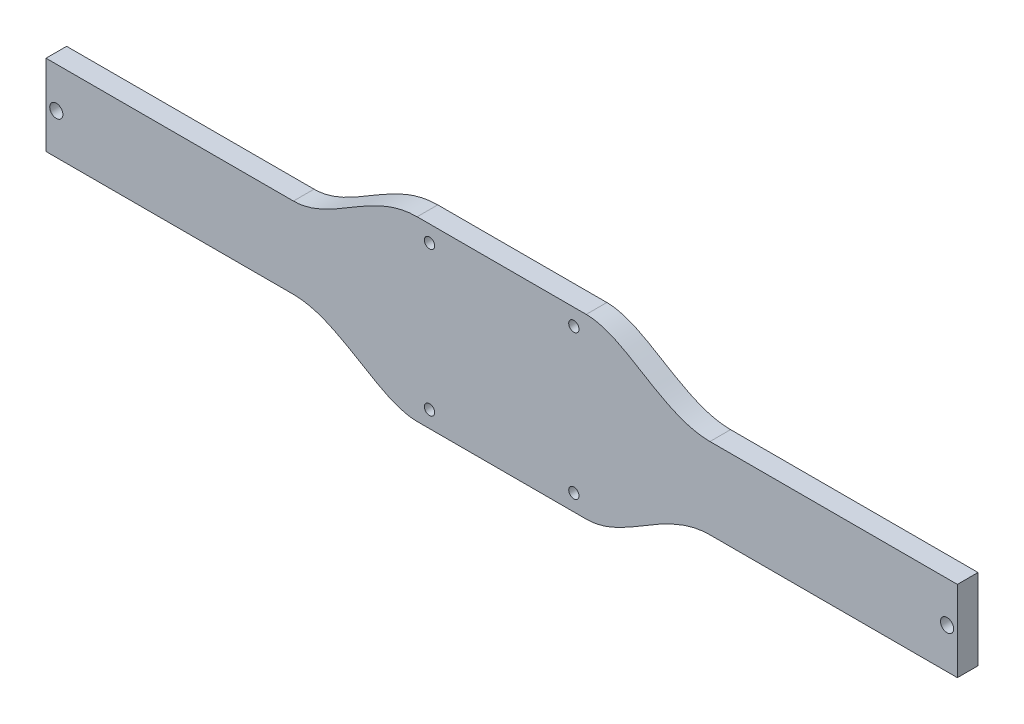
ISO-10303-21;
HEADER;
FILE_DESCRIPTION(('STEP AP214'),'2;1');
FILE_NAME('part.step','',(''),(''),'','','');
FILE_SCHEMA(('AUTOMOTIVE_DESIGN { 1 0 10303 214 1 1 1 1 }'));
ENDSEC;
DATA;
#1=APPLICATION_CONTEXT('core data for automotive mechanical design processes');
#2=APPLICATION_PROTOCOL_DEFINITION('international standard','automotive_design',2000,#1);
#3=PRODUCT_CONTEXT('',#1,'mechanical');
#4=PRODUCT('Part','Part','',(#3));
#5=PRODUCT_RELATED_PRODUCT_CATEGORY('part','',(#4));
#6=PRODUCT_DEFINITION_FORMATION('','',#4);
#7=PRODUCT_DEFINITION_CONTEXT('part definition',#1,'design');
#8=PRODUCT_DEFINITION('design','',#6,#7);
#9=PRODUCT_DEFINITION_SHAPE('','',#8);
#10=(LENGTH_UNIT() NAMED_UNIT(*) SI_UNIT(.MILLI.,.METRE.));
#11=(NAMED_UNIT(*) PLANE_ANGLE_UNIT() SI_UNIT($,.RADIAN.));
#12=(NAMED_UNIT(*) SI_UNIT($,.STERADIAN.) SOLID_ANGLE_UNIT());
#13=UNCERTAINTY_MEASURE_WITH_UNIT(LENGTH_MEASURE(1.E-05),#10,'distance_accuracy_value','');
#14=(GEOMETRIC_REPRESENTATION_CONTEXT(3) GLOBAL_UNCERTAINTY_ASSIGNED_CONTEXT((#13)) GLOBAL_UNIT_ASSIGNED_CONTEXT((#10,
#11,#12)) REPRESENTATION_CONTEXT('',''));
#15=CARTESIAN_POINT('',(0.,0.,0.));
#16=DIRECTION('',(0.,0.,1.));
#17=DIRECTION('',(1.,0.,0.));
#18=AXIS2_PLACEMENT_3D('',#15,#16,#17);
#19=CARTESIAN_POINT('',(-102.200156089066,-2.61277831462619,6.35));
#20=DIRECTION('',(0.,0.,1.));
#21=DIRECTION('',(1.,0.,0.));
#22=AXIS2_PLACEMENT_3D('',#19,#20,#21);
#23=PLANE('',#22);
#24=CARTESIAN_POINT('',(79.1547353944579,17.2627216853738,6.35));
#25=DIRECTION('',(0.,0.,1.));
#26=DIRECTION('',(1.,0.,0.));
#27=AXIS2_PLACEMENT_3D('',#24,#25,#26);
#28=CIRCLE('',#27,2.03199999968805);
#29=CARTESIAN_POINT('',(81.1867353941459,17.2627216853738,6.35));
#30=VERTEX_POINT('',#29);
#31=EDGE_CURVE('E245',#30,#30,#28,.T.);
#32=ORIENTED_EDGE('',*,*,#31,.F.);
#33=EDGE_LOOP('',(#32));
#34=FACE_BOUND('',#33,.T.);
#35=CARTESIAN_POINT('',(-80.2302646055421,-4.96227831462619,6.35));
#36=DIRECTION('',(0.,0.,1.));
#37=DIRECTION('',(1.,0.,0.));
#38=AXIS2_PLACEMENT_3D('',#35,#36,#37);
#39=CIRCLE('',#38,1.5875);
#40=CARTESIAN_POINT('',(-78.6427646055421,-4.96227831462619,6.35));
#41=VERTEX_POINT('',#40);
#42=EDGE_CURVE('E233',#41,#41,#39,.T.);
#43=ORIENTED_EDGE('',*,*,#42,.F.);
#44=EDGE_LOOP('',(#43));
#45=FACE_BOUND('',#44,.T.);
#46=CARTESIAN_POINT('',(-80.2302646055421,39.4877216853738,6.35));
#47=DIRECTION('',(0.,0.,1.));
#48=DIRECTION('',(1.,0.,0.));
#49=AXIS2_PLACEMENT_3D('',#46,#47,#48);
#50=CIRCLE('',#49,1.58749999999999);
#51=CARTESIAN_POINT('',(-78.6427646055422,39.4877216853738,6.35));
#52=VERTEX_POINT('',#51);
#53=EDGE_CURVE('E225',#52,#52,#50,.T.);
#54=ORIENTED_EDGE('',*,*,#53,.F.);
#55=EDGE_LOOP('',(#54));
#56=FACE_BOUND('',#55,.T.);
#57=DIRECTION('',(0.,-1.,0.));
#58=VECTOR('',#57,1.);
#59=CARTESIAN_POINT('',(-198.340264605542,29.7087216853738,6.35));
#60=LINE('',#59,#58);
#61=CARTESIAN_POINT('',(-198.340264605542,29.7087216853738,6.35));
#62=VERTEX_POINT('',#61);
#63=CARTESIAN_POINT('',(-198.340264605542,4.81672168537382,6.35));
#64=VERTEX_POINT('',#63);
#65=EDGE_CURVE('E220',#62,#64,#60,.T.);
#66=ORIENTED_EDGE('',*,*,#65,.T.);
#67=DIRECTION('',(1.,0.,0.));
#68=VECTOR('',#67,1.);
#69=CARTESIAN_POINT('',(-198.340264605542,4.81672168537382,6.35));
#70=LINE('',#69,#68);
#71=CARTESIAN_POINT('',(-122.140264605542,4.81672168537382,6.35));
#72=VERTEX_POINT('',#71);
#73=EDGE_CURVE('E104',#64,#72,#70,.T.);
#74=ORIENTED_EDGE('',*,*,#73,.T.);
#75=CARTESIAN_POINT('',(-122.140264605542,4.81672168537382,6.35));
#76=CARTESIAN_POINT('',(-107.820723209487,4.81672168537391,6.35));
#77=CARTESIAN_POINT('',(-95.9861832909939,-10.0422783146263,6.35));
#78=CARTESIAN_POINT('',(-84.0402646055422,-10.0422783146262,6.35));
#79=B_SPLINE_CURVE_WITH_KNOTS('',3,(#75,#76,#77,#78),.UNSPECIFIED.,.F.,.F.,(4,4),(0.,1.),.UNSPECIFIED.);
#80=CARTESIAN_POINT('',(-84.0402646055422,-10.0422783146262,6.35));
#81=VERTEX_POINT('',#80);
#82=EDGE_CURVE('E211',#72,#81,#79,.T.);
#83=ORIENTED_EDGE('',*,*,#82,.T.);
#84=DIRECTION('',(1.,0.,0.));
#85=VECTOR('',#84,1.);
#86=CARTESIAN_POINT('',(-84.0402646055422,-10.0422783146262,6.35));
#87=LINE('',#86,#85);
#88=CARTESIAN_POINT('',(-31.9702646055421,-10.0422783146262,6.35));
#89=VERTEX_POINT('',#88);
#90=EDGE_CURVE('E191',#81,#89,#87,.T.);
#91=ORIENTED_EDGE('',*,*,#90,.T.);
#92=CARTESIAN_POINT('',(-31.9702646055421,-10.0422783146262,6.35));
#93=CARTESIAN_POINT('',(-19.8459949741253,-10.0422783146262,6.35));
#94=CARTESIAN_POINT('',(-8.14813011694098,4.81672168537381,6.35));
#95=CARTESIAN_POINT('',(6.12973539445788,4.81672168537381,6.35));
#96=B_SPLINE_CURVE_WITH_KNOTS('',3,(#92,#93,#94,#95),.UNSPECIFIED.,.F.,.F.,(4,4),(0.,1.),.UNSPECIFIED.);
#97=CARTESIAN_POINT('',(6.12973539445788,4.81672168537381,6.35));
#98=VERTEX_POINT('',#97);
#99=EDGE_CURVE('E186',#89,#98,#96,.T.);
#100=ORIENTED_EDGE('',*,*,#99,.T.);
#101=DIRECTION('',(1.,0.,0.));
#102=VECTOR('',#101,1.);
#103=CARTESIAN_POINT('',(6.12973539445788,4.81672168537381,6.35));
#104=LINE('',#103,#102);
#105=CARTESIAN_POINT('',(82.3297353944579,4.81672168537381,6.35));
#106=VERTEX_POINT('',#105);
#107=EDGE_CURVE('E184',#98,#106,#104,.T.);
#108=ORIENTED_EDGE('',*,*,#107,.T.);
#109=DIRECTION('',(0.,1.,0.));
#110=VECTOR('',#109,1.);
#111=CARTESIAN_POINT('',(82.3297353944579,29.7087216853738,6.35));
#112=LINE('',#111,#110);
#113=CARTESIAN_POINT('',(82.3297353944579,29.7087216853738,6.35));
#114=VERTEX_POINT('',#113);
#115=EDGE_CURVE('E182',#106,#114,#112,.T.);
#116=ORIENTED_EDGE('',*,*,#115,.T.);
#117=DIRECTION('',(-1.,0.,0.));
#118=VECTOR('',#117,1.);
#119=CARTESIAN_POINT('',(6.12973539445788,29.7087216853738,6.35));
#120=LINE('',#119,#118);
#121=CARTESIAN_POINT('',(6.12973539445788,29.7087216853738,6.35));
#122=VERTEX_POINT('',#121);
#123=EDGE_CURVE('E177',#114,#122,#120,.T.);
#124=ORIENTED_EDGE('',*,*,#123,.T.);
#125=CARTESIAN_POINT('',(6.12973539445788,29.7087216853738,6.35));
#126=CARTESIAN_POINT('',(-8.48247049567898,29.7087216853738,6.35));
#127=CARTESIAN_POINT('',(-19.8459949826375,44.5677216853738,6.35));
#128=CARTESIAN_POINT('',(-31.9702646055421,44.5677216853738,6.35));
#129=B_SPLINE_CURVE_WITH_KNOTS('',3,(#125,#126,#127,#128),.UNSPECIFIED.,.F.,.F.,(4,4),(0.,1.),.UNSPECIFIED.);
#130=CARTESIAN_POINT('',(-31.9702646055421,44.5677216853738,6.35));
#131=VERTEX_POINT('',#130);
#132=EDGE_CURVE('E135',#122,#131,#129,.T.);
#133=ORIENTED_EDGE('',*,*,#132,.T.);
#134=DIRECTION('',(-1.,0.,0.));
#135=VECTOR('',#134,1.);
#136=CARTESIAN_POINT('',(-84.0402646055422,44.5677216853738,6.35));
#137=LINE('',#136,#135);
#138=CARTESIAN_POINT('',(-84.0402646055422,44.5677216853738,6.35));
#139=VERTEX_POINT('',#138);
#140=EDGE_CURVE('E129',#131,#139,#137,.T.);
#141=ORIENTED_EDGE('',*,*,#140,.T.);
#142=CARTESIAN_POINT('',(-84.0402646055422,44.5677216853738,6.35));
#143=CARTESIAN_POINT('',(-98.3598060015969,44.5677216853737,6.35));
#144=CARTESIAN_POINT('',(-110.19434592009,29.7087216853738,6.35));
#145=CARTESIAN_POINT('',(-122.140264605542,29.7087216853738,6.35));
#146=B_SPLINE_CURVE_WITH_KNOTS('',3,(#142,#143,#144,#145),.UNSPECIFIED.,.F.,.F.,(4,4),(0.,1.),.UNSPECIFIED.);
#147=CARTESIAN_POINT('',(-122.140264605542,29.7087216853738,6.35));
#148=VERTEX_POINT('',#147);
#149=EDGE_CURVE('E133',#139,#148,#146,.T.);
#150=ORIENTED_EDGE('',*,*,#149,.T.);
#151=DIRECTION('',(-1.,0.,0.));
#152=VECTOR('',#151,1.);
#153=CARTESIAN_POINT('',(-198.340264605542,29.7087216853738,6.35));
#154=LINE('',#153,#152);
#155=EDGE_CURVE('E49',#148,#62,#154,.T.);
#156=ORIENTED_EDGE('',*,*,#155,.T.);
#157=EDGE_LOOP('',(#66,#74,#83,#91,#100,#108,#116,#124,#133,#141,#150,#156));
#158=FACE_BOUND('',#157,.T.);
#159=CARTESIAN_POINT('',(-35.7802646055421,39.4877216853738,6.35));
#160=DIRECTION('',(0.,0.,1.));
#161=DIRECTION('',(1.,0.,0.));
#162=AXIS2_PLACEMENT_3D('',#159,#160,#161);
#163=CIRCLE('',#162,1.5875);
#164=CARTESIAN_POINT('',(-34.1927646055421,39.4877216853738,6.35));
#165=VERTEX_POINT('',#164);
#166=EDGE_CURVE('E226',#165,#165,#163,.T.);
#167=ORIENTED_EDGE('',*,*,#166,.F.);
#168=EDGE_LOOP('',(#167));
#169=FACE_BOUND('',#168,.T.);
#170=CARTESIAN_POINT('',(-35.7802646055421,-4.96227831462619,6.35));
#171=DIRECTION('',(0.,0.,1.));
#172=DIRECTION('',(1.,0.,0.));
#173=AXIS2_PLACEMENT_3D('',#170,#171,#172);
#174=CIRCLE('',#173,1.5875);
#175=CARTESIAN_POINT('',(-34.1927646055421,-4.96227831462619,6.35));
#176=VERTEX_POINT('',#175);
#177=EDGE_CURVE('E239',#176,#176,#174,.T.);
#178=ORIENTED_EDGE('',*,*,#177,.F.);
#179=EDGE_LOOP('',(#178));
#180=FACE_BOUND('',#179,.T.);
#181=CARTESIAN_POINT('',(-195.165264605542,17.2627216853738,6.35));
#182=DIRECTION('',(0.,0.,1.));
#183=DIRECTION('',(-1.,0.,0.));
#184=AXIS2_PLACEMENT_3D('',#181,#182,#183);
#185=CIRCLE('',#184,2.03199999968802);
#186=CARTESIAN_POINT('',(-197.19726460523,17.2627216853738,6.35));
#187=VERTEX_POINT('',#186);
#188=EDGE_CURVE('E251',#187,#187,#185,.T.);
#189=ORIENTED_EDGE('',*,*,#188,.F.);
#190=EDGE_LOOP('',(#189));
#191=FACE_BOUND('',#190,.T.);
#192=ADVANCED_FACE('F32',(#34,#45,#56,#158,#169,#180,#191),#23,.T.);
#193=CARTESIAN_POINT('',(-102.200156089066,-2.61277831462619,0.));
#194=DIRECTION('',(0.,0.,1.));
#195=DIRECTION('',(1.,0.,0.));
#196=AXIS2_PLACEMENT_3D('',#193,#194,#195);
#197=PLANE('',#196);
#198=CARTESIAN_POINT('',(79.1547353944579,17.2627216853738,0.));
#199=DIRECTION('',(0.,0.,1.));
#200=DIRECTION('',(1.,0.,0.));
#201=AXIS2_PLACEMENT_3D('',#198,#199,#200);
#202=CIRCLE('',#201,2.03199999968805);
#203=CARTESIAN_POINT('',(81.1867353941459,17.2627216853738,0.));
#204=VERTEX_POINT('',#203);
#205=EDGE_CURVE('E248',#204,#204,#202,.T.);
#206=ORIENTED_EDGE('',*,*,#205,.T.);
#207=EDGE_LOOP('',(#206));
#208=FACE_BOUND('',#207,.T.);
#209=CARTESIAN_POINT('',(-80.2302646055421,-4.96227831462619,0.));
#210=DIRECTION('',(0.,0.,1.));
#211=DIRECTION('',(1.,0.,0.));
#212=AXIS2_PLACEMENT_3D('',#209,#210,#211);
#213=CIRCLE('',#212,1.5875);
#214=CARTESIAN_POINT('',(-78.6427646055421,-4.96227831462619,0.));
#215=VERTEX_POINT('',#214);
#216=EDGE_CURVE('E236',#215,#215,#213,.T.);
#217=ORIENTED_EDGE('',*,*,#216,.T.);
#218=EDGE_LOOP('',(#217));
#219=FACE_BOUND('',#218,.T.);
#220=CARTESIAN_POINT('',(-80.2302646055421,39.4877216853738,0.));
#221=DIRECTION('',(0.,0.,1.));
#222=DIRECTION('',(1.,0.,0.));
#223=AXIS2_PLACEMENT_3D('',#220,#221,#222);
#224=CIRCLE('',#223,1.58749999999999);
#225=CARTESIAN_POINT('',(-78.6427646055422,39.4877216853738,0.));
#226=VERTEX_POINT('',#225);
#227=EDGE_CURVE('E222',#226,#226,#224,.T.);
#228=ORIENTED_EDGE('',*,*,#227,.T.);
#229=EDGE_LOOP('',(#228));
#230=FACE_BOUND('',#229,.T.);
#231=DIRECTION('',(0.,-1.,0.));
#232=VECTOR('',#231,1.);
#233=CARTESIAN_POINT('',(-198.340264605542,29.7087216853738,0.));
#234=LINE('',#233,#232);
#235=CARTESIAN_POINT('',(-198.340264605542,29.7087216853738,0.));
#236=VERTEX_POINT('',#235);
#237=CARTESIAN_POINT('',(-198.340264605542,4.81672168537382,0.));
#238=VERTEX_POINT('',#237);
#239=EDGE_CURVE('E229',#236,#238,#234,.T.);
#240=ORIENTED_EDGE('',*,*,#239,.F.);
#241=DIRECTION('',(-1.,0.,0.));
#242=VECTOR('',#241,1.);
#243=CARTESIAN_POINT('',(-198.340264605542,29.7087216853738,0.));
#244=LINE('',#243,#242);
#245=CARTESIAN_POINT('',(-122.140264605542,29.7087216853738,0.));
#246=VERTEX_POINT('',#245);
#247=EDGE_CURVE('E96',#246,#236,#244,.T.);
#248=ORIENTED_EDGE('',*,*,#247,.F.);
#249=CARTESIAN_POINT('',(-84.0402646055422,44.5677216853738,0.));
#250=CARTESIAN_POINT('',(-98.3598060015969,44.5677216853737,0.));
#251=CARTESIAN_POINT('',(-110.19434592009,29.7087216853738,0.));
#252=CARTESIAN_POINT('',(-122.140264605542,29.7087216853738,0.));
#253=B_SPLINE_CURVE_WITH_KNOTS('',3,(#249,#250,#251,#252),.UNSPECIFIED.,.F.,.F.,(4,4),(0.,1.),.UNSPECIFIED.);
#254=CARTESIAN_POINT('',(-84.0402646055422,44.5677216853738,0.));
#255=VERTEX_POINT('',#254);
#256=EDGE_CURVE('E90',#255,#246,#253,.T.);
#257=ORIENTED_EDGE('',*,*,#256,.F.);
#258=DIRECTION('',(-1.,0.,0.));
#259=VECTOR('',#258,1.);
#260=CARTESIAN_POINT('',(-84.0402646055422,44.5677216853738,0.));
#261=LINE('',#260,#259);
#262=CARTESIAN_POINT('',(-31.9702646055421,44.5677216853738,0.));
#263=VERTEX_POINT('',#262);
#264=EDGE_CURVE('E143',#263,#255,#261,.T.);
#265=ORIENTED_EDGE('',*,*,#264,.F.);
#266=CARTESIAN_POINT('',(6.12973539445788,29.7087216853738,0.));
#267=CARTESIAN_POINT('',(-8.48247049567898,29.7087216853738,0.));
#268=CARTESIAN_POINT('',(-19.8459949826375,44.5677216853738,0.));
#269=CARTESIAN_POINT('',(-31.9702646055421,44.5677216853738,0.));
#270=B_SPLINE_CURVE_WITH_KNOTS('',3,(#266,#267,#268,#269),.UNSPECIFIED.,.F.,.F.,(4,4),(0.,1.),.UNSPECIFIED.);
#271=CARTESIAN_POINT('',(6.12973539445788,29.7087216853738,0.));
#272=VERTEX_POINT('',#271);
#273=EDGE_CURVE('E454',#272,#263,#270,.T.);
#274=ORIENTED_EDGE('',*,*,#273,.F.);
#275=DIRECTION('',(-1.,0.,0.));
#276=VECTOR('',#275,1.);
#277=CARTESIAN_POINT('',(6.12973539445788,29.7087216853738,0.));
#278=LINE('',#277,#276);
#279=CARTESIAN_POINT('',(82.3297353944579,29.7087216853738,0.));
#280=VERTEX_POINT('',#279);
#281=EDGE_CURVE('E452',#280,#272,#278,.T.);
#282=ORIENTED_EDGE('',*,*,#281,.F.);
#283=DIRECTION('',(0.,1.,0.));
#284=VECTOR('',#283,1.);
#285=CARTESIAN_POINT('',(82.3297353944579,29.7087216853738,0.));
#286=LINE('',#285,#284);
#287=CARTESIAN_POINT('',(82.3297353944579,4.81672168537381,0.));
#288=VERTEX_POINT('',#287);
#289=EDGE_CURVE('E450',#288,#280,#286,.T.);
#290=ORIENTED_EDGE('',*,*,#289,.F.);
#291=DIRECTION('',(1.,0.,0.));
#292=VECTOR('',#291,1.);
#293=CARTESIAN_POINT('',(6.12973539445788,4.81672168537381,0.));
#294=LINE('',#293,#292);
#295=CARTESIAN_POINT('',(6.12973539445788,4.81672168537381,0.));
#296=VERTEX_POINT('',#295);
#297=EDGE_CURVE('E445',#296,#288,#294,.T.);
#298=ORIENTED_EDGE('',*,*,#297,.F.);
#299=CARTESIAN_POINT('',(-31.9702646055421,-10.0422783146262,0.));
#300=CARTESIAN_POINT('',(-19.8459949741253,-10.0422783146262,0.));
#301=CARTESIAN_POINT('',(-8.14813011694098,4.81672168537381,0.));
#302=CARTESIAN_POINT('',(6.12973539445788,4.81672168537381,0.));
#303=B_SPLINE_CURVE_WITH_KNOTS('',3,(#299,#300,#301,#302),.UNSPECIFIED.,.F.,.F.,(4,4),(0.,1.),.UNSPECIFIED.);
#304=CARTESIAN_POINT('',(-31.9702646055421,-10.0422783146262,0.));
#305=VERTEX_POINT('',#304);
#306=EDGE_CURVE('E441',#305,#296,#303,.T.);
#307=ORIENTED_EDGE('',*,*,#306,.F.);
#308=DIRECTION('',(1.,0.,0.));
#309=VECTOR('',#308,1.);
#310=CARTESIAN_POINT('',(-84.0402646055422,-10.0422783146262,0.));
#311=LINE('',#310,#309);
#312=CARTESIAN_POINT('',(-84.0402646055422,-10.0422783146262,0.));
#313=VERTEX_POINT('',#312);
#314=EDGE_CURVE('E436',#313,#305,#311,.T.);
#315=ORIENTED_EDGE('',*,*,#314,.F.);
#316=CARTESIAN_POINT('',(-122.140264605542,4.81672168537382,0.));
#317=CARTESIAN_POINT('',(-107.820723209487,4.81672168537391,0.));
#318=CARTESIAN_POINT('',(-95.9861832909939,-10.0422783146263,0.));
#319=CARTESIAN_POINT('',(-84.0402646055422,-10.0422783146262,0.));
#320=B_SPLINE_CURVE_WITH_KNOTS('',3,(#316,#317,#318,#319),.UNSPECIFIED.,.F.,.F.,(4,4),(0.,1.),.UNSPECIFIED.);
#321=CARTESIAN_POINT('',(-122.140264605542,4.81672168537382,0.));
#322=VERTEX_POINT('',#321);
#323=EDGE_CURVE('E430',#322,#313,#320,.T.);
#324=ORIENTED_EDGE('',*,*,#323,.F.);
#325=DIRECTION('',(1.,0.,0.));
#326=VECTOR('',#325,1.);
#327=CARTESIAN_POINT('',(-198.340264605542,4.81672168537382,0.));
#328=LINE('',#327,#326);
#329=EDGE_CURVE('E429',#238,#322,#328,.T.);
#330=ORIENTED_EDGE('',*,*,#329,.F.);
#331=EDGE_LOOP('',(#240,#248,#257,#265,#274,#282,#290,#298,#307,#315,#324,#330));
#332=FACE_BOUND('',#331,.T.);
#333=CARTESIAN_POINT('',(-35.7802646055421,39.4877216853738,0.));
#334=DIRECTION('',(0.,0.,1.));
#335=DIRECTION('',(1.,0.,0.));
#336=AXIS2_PLACEMENT_3D('',#333,#334,#335);
#337=CIRCLE('',#336,1.5875);
#338=CARTESIAN_POINT('',(-34.1927646055421,39.4877216853738,0.));
#339=VERTEX_POINT('',#338);
#340=EDGE_CURVE('E230',#339,#339,#337,.T.);
#341=ORIENTED_EDGE('',*,*,#340,.T.);
#342=EDGE_LOOP('',(#341));
#343=FACE_BOUND('',#342,.T.);
#344=CARTESIAN_POINT('',(-35.7802646055421,-4.96227831462619,0.));
#345=DIRECTION('',(0.,0.,1.));
#346=DIRECTION('',(1.,0.,0.));
#347=AXIS2_PLACEMENT_3D('',#344,#345,#346);
#348=CIRCLE('',#347,1.5875);
#349=CARTESIAN_POINT('',(-34.1927646055421,-4.96227831462619,0.));
#350=VERTEX_POINT('',#349);
#351=EDGE_CURVE('E242',#350,#350,#348,.T.);
#352=ORIENTED_EDGE('',*,*,#351,.T.);
#353=EDGE_LOOP('',(#352));
#354=FACE_BOUND('',#353,.T.);
#355=CARTESIAN_POINT('',(-195.165264605542,17.2627216853738,0.));
#356=DIRECTION('',(0.,0.,1.));
#357=DIRECTION('',(-1.,0.,0.));
#358=AXIS2_PLACEMENT_3D('',#355,#356,#357);
#359=CIRCLE('',#358,2.03199999968802);
#360=CARTESIAN_POINT('',(-197.19726460523,17.2627216853738,0.));
#361=VERTEX_POINT('',#360);
#362=EDGE_CURVE('E254',#361,#361,#359,.T.);
#363=ORIENTED_EDGE('',*,*,#362,.T.);
#364=EDGE_LOOP('',(#363));
#365=FACE_BOUND('',#364,.T.);
#366=ADVANCED_FACE('F264',(#208,#219,#230,#332,#343,#354,#365),#197,.F.);
#367=CARTESIAN_POINT('',(-198.340264605542,29.7087216853738,6.35));
#368=DIRECTION('',(1.,0.,0.));
#369=DIRECTION('',(0.,0.,-1.));
#370=AXIS2_PLACEMENT_3D('',#367,#368,#369);
#371=PLANE('',#370);
#372=ORIENTED_EDGE('',*,*,#239,.T.);
#373=DIRECTION('',(0.,0.,-1.));
#374=VECTOR('',#373,1.);
#375=CARTESIAN_POINT('',(-198.340264605542,4.81672168537382,6.35));
#376=LINE('',#375,#374);
#377=EDGE_CURVE('E11',#64,#238,#376,.T.);
#378=ORIENTED_EDGE('',*,*,#377,.F.);
#379=ORIENTED_EDGE('',*,*,#65,.F.);
#380=DIRECTION('',(0.,0.,-1.));
#381=VECTOR('',#380,1.);
#382=CARTESIAN_POINT('',(-198.340264605542,29.7087216853738,6.35));
#383=LINE('',#382,#381);
#384=EDGE_CURVE('E149',#62,#236,#383,.T.);
#385=ORIENTED_EDGE('',*,*,#384,.T.);
#386=EDGE_LOOP('',(#372,#378,#379,#385));
#387=FACE_BOUND('',#386,.T.);
#388=ADVANCED_FACE('F34',(#387),#371,.F.);
#389=CARTESIAN_POINT('',(-198.340264605542,4.81672168537382,6.35));
#390=DIRECTION('',(0.,1.,0.));
#391=DIRECTION('',(-1.,0.,0.));
#392=AXIS2_PLACEMENT_3D('',#389,#390,#391);
#393=PLANE('',#392);
#394=ORIENTED_EDGE('',*,*,#329,.T.);
#395=DIRECTION('',(0.,0.,-1.));
#396=VECTOR('',#395,1.);
#397=CARTESIAN_POINT('',(-122.140264605542,4.81672168537382,6.35));
#398=LINE('',#397,#396);
#399=EDGE_CURVE('E41',#72,#322,#398,.T.);
#400=ORIENTED_EDGE('',*,*,#399,.F.);
#401=ORIENTED_EDGE('',*,*,#73,.F.);
#402=ORIENTED_EDGE('',*,*,#377,.T.);
#403=EDGE_LOOP('',(#394,#400,#401,#402));
#404=FACE_BOUND('',#403,.T.);
#405=ADVANCED_FACE('F209',(#404),#393,.F.);
#406=DIRECTION('',(0.,0.,-1.));
#407=VECTOR('',#406,1.);
#408=SURFACE_OF_LINEAR_EXTRUSION('',#79,#407);
#409=ORIENTED_EDGE('',*,*,#323,.T.);
#410=DIRECTION('',(0.,0.,-1.));
#411=VECTOR('',#410,1.);
#412=CARTESIAN_POINT('',(-84.0402646055422,-10.0422783146262,6.35));
#413=LINE('',#412,#411);
#414=EDGE_CURVE('E487',#81,#313,#413,.T.);
#415=ORIENTED_EDGE('',*,*,#414,.F.);
#416=ORIENTED_EDGE('',*,*,#82,.F.);
#417=ORIENTED_EDGE('',*,*,#399,.T.);
#418=EDGE_LOOP('',(#409,#415,#416,#417));
#419=FACE_BOUND('',#418,.T.);
#420=ADVANCED_FACE('F206',(#419),#408,.F.);
#421=CARTESIAN_POINT('',(-84.0402646055422,-10.0422783146262,6.35));
#422=DIRECTION('',(0.,1.,0.));
#423=DIRECTION('',(0.,0.,1.));
#424=AXIS2_PLACEMENT_3D('',#421,#422,#423);
#425=PLANE('',#424);
#426=ORIENTED_EDGE('',*,*,#314,.T.);
#427=DIRECTION('',(0.,0.,-1.));
#428=VECTOR('',#427,1.);
#429=CARTESIAN_POINT('',(-31.9702646055421,-10.0422783146262,6.35));
#430=LINE('',#429,#428);
#431=EDGE_CURVE('E484',#89,#305,#430,.T.);
#432=ORIENTED_EDGE('',*,*,#431,.F.);
#433=ORIENTED_EDGE('',*,*,#90,.F.);
#434=ORIENTED_EDGE('',*,*,#414,.T.);
#435=EDGE_LOOP('',(#426,#432,#433,#434));
#436=FACE_BOUND('',#435,.T.);
#437=ADVANCED_FACE('F202',(#436),#425,.F.);
#438=DIRECTION('',(0.,0.,-1.));
#439=VECTOR('',#438,1.);
#440=SURFACE_OF_LINEAR_EXTRUSION('',#96,#439);
#441=ORIENTED_EDGE('',*,*,#306,.T.);
#442=DIRECTION('',(0.,0.,-1.));
#443=VECTOR('',#442,1.);
#444=CARTESIAN_POINT('',(6.12973539445788,4.81672168537381,6.35));
#445=LINE('',#444,#443);
#446=EDGE_CURVE('E481',#98,#296,#445,.T.);
#447=ORIENTED_EDGE('',*,*,#446,.F.);
#448=ORIENTED_EDGE('',*,*,#99,.F.);
#449=ORIENTED_EDGE('',*,*,#431,.T.);
#450=EDGE_LOOP('',(#441,#447,#448,#449));
#451=FACE_BOUND('',#450,.T.);
#452=ADVANCED_FACE('F197',(#451),#440,.F.);
#453=CARTESIAN_POINT('',(6.12973539445788,4.81672168537381,6.35));
#454=DIRECTION('',(0.,1.,0.));
#455=DIRECTION('',(-1.,0.,0.));
#456=AXIS2_PLACEMENT_3D('',#453,#454,#455);
#457=PLANE('',#456);
#458=ORIENTED_EDGE('',*,*,#297,.T.);
#459=DIRECTION('',(0.,0.,-1.));
#460=VECTOR('',#459,1.);
#461=CARTESIAN_POINT('',(82.3297353944579,4.81672168537381,6.35));
#462=LINE('',#461,#460);
#463=EDGE_CURVE('E478',#106,#288,#462,.T.);
#464=ORIENTED_EDGE('',*,*,#463,.F.);
#465=ORIENTED_EDGE('',*,*,#107,.F.);
#466=ORIENTED_EDGE('',*,*,#446,.T.);
#467=EDGE_LOOP('',(#458,#464,#465,#466));
#468=FACE_BOUND('',#467,.T.);
#469=ADVANCED_FACE('F201',(#468),#457,.F.);
#470=CARTESIAN_POINT('',(82.3297353944579,29.7087216853738,6.35));
#471=DIRECTION('',(-1.,0.,0.));
#472=DIRECTION('',(0.,0.,1.));
#473=AXIS2_PLACEMENT_3D('',#470,#471,#472);
#474=PLANE('',#473);
#475=ORIENTED_EDGE('',*,*,#289,.T.);
#476=DIRECTION('',(0.,0.,-1.));
#477=VECTOR('',#476,1.);
#478=CARTESIAN_POINT('',(82.3297353944579,29.7087216853738,6.35));
#479=LINE('',#478,#477);
#480=EDGE_CURVE('E475',#114,#280,#479,.T.);
#481=ORIENTED_EDGE('',*,*,#480,.F.);
#482=ORIENTED_EDGE('',*,*,#115,.F.);
#483=ORIENTED_EDGE('',*,*,#463,.T.);
#484=EDGE_LOOP('',(#475,#481,#482,#483));
#485=FACE_BOUND('',#484,.T.);
#486=ADVANCED_FACE('F340',(#485),#474,.F.);
#487=CARTESIAN_POINT('',(6.12973539445788,29.7087216853738,6.35));
#488=DIRECTION('',(0.,-1.,0.));
#489=DIRECTION('',(0.,0.,-1.));
#490=AXIS2_PLACEMENT_3D('',#487,#488,#489);
#491=PLANE('',#490);
#492=ORIENTED_EDGE('',*,*,#281,.T.);
#493=DIRECTION('',(0.,0.,-1.));
#494=VECTOR('',#493,1.);
#495=CARTESIAN_POINT('',(6.12973539445788,29.7087216853738,6.35));
#496=LINE('',#495,#494);
#497=EDGE_CURVE('E472',#122,#272,#496,.T.);
#498=ORIENTED_EDGE('',*,*,#497,.F.);
#499=ORIENTED_EDGE('',*,*,#123,.F.);
#500=ORIENTED_EDGE('',*,*,#480,.T.);
#501=EDGE_LOOP('',(#492,#498,#499,#500));
#502=FACE_BOUND('',#501,.T.);
#503=ADVANCED_FACE('F170',(#502),#491,.F.);
#504=DIRECTION('',(0.,0.,-1.));
#505=VECTOR('',#504,1.);
#506=SURFACE_OF_LINEAR_EXTRUSION('',#129,#505);
#507=ORIENTED_EDGE('',*,*,#273,.T.);
#508=DIRECTION('',(0.,0.,-1.));
#509=VECTOR('',#508,1.);
#510=CARTESIAN_POINT('',(-31.9702646055421,44.5677216853738,6.35));
#511=LINE('',#510,#509);
#512=EDGE_CURVE('E144',#131,#263,#511,.T.);
#513=ORIENTED_EDGE('',*,*,#512,.F.);
#514=ORIENTED_EDGE('',*,*,#132,.F.);
#515=ORIENTED_EDGE('',*,*,#497,.T.);
#516=EDGE_LOOP('',(#507,#513,#514,#515));
#517=FACE_BOUND('',#516,.T.);
#518=ADVANCED_FACE('F167',(#517),#506,.F.);
#519=CARTESIAN_POINT('',(-84.0402646055422,44.5677216853738,6.35));
#520=DIRECTION('',(0.,-1.,0.));
#521=DIRECTION('',(0.,0.,-1.));
#522=AXIS2_PLACEMENT_3D('',#519,#520,#521);
#523=PLANE('',#522);
#524=ORIENTED_EDGE('',*,*,#264,.T.);
#525=DIRECTION('',(0.,0.,-1.));
#526=VECTOR('',#525,1.);
#527=CARTESIAN_POINT('',(-84.0402646055422,44.5677216853738,6.35));
#528=LINE('',#527,#526);
#529=EDGE_CURVE('E140',#139,#255,#528,.T.);
#530=ORIENTED_EDGE('',*,*,#529,.F.);
#531=ORIENTED_EDGE('',*,*,#140,.F.);
#532=ORIENTED_EDGE('',*,*,#512,.T.);
#533=EDGE_LOOP('',(#524,#530,#531,#532));
#534=FACE_BOUND('',#533,.T.);
#535=ADVANCED_FACE('F141',(#534),#523,.F.);
#536=DIRECTION('',(0.,0.,-1.));
#537=VECTOR('',#536,1.);
#538=SURFACE_OF_LINEAR_EXTRUSION('',#146,#537);
#539=ORIENTED_EDGE('',*,*,#256,.T.);
#540=DIRECTION('',(0.,0.,-1.));
#541=VECTOR('',#540,1.);
#542=CARTESIAN_POINT('',(-122.140264605542,29.7087216853738,6.35));
#543=LINE('',#542,#541);
#544=EDGE_CURVE('E145',#148,#246,#543,.T.);
#545=ORIENTED_EDGE('',*,*,#544,.F.);
#546=ORIENTED_EDGE('',*,*,#149,.F.);
#547=ORIENTED_EDGE('',*,*,#529,.T.);
#548=EDGE_LOOP('',(#539,#545,#546,#547));
#549=FACE_BOUND('',#548,.T.);
#550=ADVANCED_FACE('F147',(#549),#538,.F.);
#551=CARTESIAN_POINT('',(-198.340264605542,29.7087216853738,6.35));
#552=DIRECTION('',(0.,-1.,0.));
#553=DIRECTION('',(0.,0.,-1.));
#554=AXIS2_PLACEMENT_3D('',#551,#552,#553);
#555=PLANE('',#554);
#556=ORIENTED_EDGE('',*,*,#247,.T.);
#557=ORIENTED_EDGE('',*,*,#384,.F.);
#558=ORIENTED_EDGE('',*,*,#155,.F.);
#559=ORIENTED_EDGE('',*,*,#544,.T.);
#560=EDGE_LOOP('',(#556,#557,#558,#559));
#561=FACE_BOUND('',#560,.T.);
#562=ADVANCED_FACE('F163',(#561),#555,.F.);
#563=CARTESIAN_POINT('',(-80.2302646055421,39.4877216853738,6.35));
#564=DIRECTION('',(0.,0.,-1.));
#565=DIRECTION('',(-1.,0.,0.));
#566=AXIS2_PLACEMENT_3D('',#563,#564,#565);
#567=CYLINDRICAL_SURFACE('',#566,1.58749999999999);
#568=ORIENTED_EDGE('',*,*,#53,.T.);
#569=EDGE_LOOP('',(#568));
#570=FACE_BOUND('',#569,.T.);
#571=ORIENTED_EDGE('',*,*,#227,.F.);
#572=EDGE_LOOP('',(#571));
#573=FACE_BOUND('',#572,.T.);
#574=ADVANCED_FACE('F274',(#570,#573),#567,.F.);
#575=CARTESIAN_POINT('',(-35.7802646055421,39.4877216853738,6.35));
#576=DIRECTION('',(0.,0.,-1.));
#577=DIRECTION('',(-1.,0.,0.));
#578=AXIS2_PLACEMENT_3D('',#575,#576,#577);
#579=CYLINDRICAL_SURFACE('',#578,1.5875);
#580=ORIENTED_EDGE('',*,*,#166,.T.);
#581=EDGE_LOOP('',(#580));
#582=FACE_BOUND('',#581,.T.);
#583=ORIENTED_EDGE('',*,*,#340,.F.);
#584=EDGE_LOOP('',(#583));
#585=FACE_BOUND('',#584,.T.);
#586=ADVANCED_FACE('F277',(#582,#585),#579,.F.);
#587=CARTESIAN_POINT('',(-80.2302646055421,-4.96227831462619,6.35));
#588=DIRECTION('',(0.,0.,-1.));
#589=DIRECTION('',(-1.,0.,0.));
#590=AXIS2_PLACEMENT_3D('',#587,#588,#589);
#591=CYLINDRICAL_SURFACE('',#590,1.5875);
#592=ORIENTED_EDGE('',*,*,#42,.T.);
#593=EDGE_LOOP('',(#592));
#594=FACE_BOUND('',#593,.T.);
#595=ORIENTED_EDGE('',*,*,#216,.F.);
#596=EDGE_LOOP('',(#595));
#597=FACE_BOUND('',#596,.T.);
#598=ADVANCED_FACE('F281',(#594,#597),#591,.F.);
#599=CARTESIAN_POINT('',(-35.7802646055421,-4.96227831462619,6.35));
#600=DIRECTION('',(0.,0.,-1.));
#601=DIRECTION('',(-1.,0.,0.));
#602=AXIS2_PLACEMENT_3D('',#599,#600,#601);
#603=CYLINDRICAL_SURFACE('',#602,1.5875);
#604=ORIENTED_EDGE('',*,*,#177,.T.);
#605=EDGE_LOOP('',(#604));
#606=FACE_BOUND('',#605,.T.);
#607=ORIENTED_EDGE('',*,*,#351,.F.);
#608=EDGE_LOOP('',(#607));
#609=FACE_BOUND('',#608,.T.);
#610=ADVANCED_FACE('F285',(#606,#609),#603,.F.);
#611=CARTESIAN_POINT('',(79.1547353944579,17.2627216853738,6.35));
#612=DIRECTION('',(0.,0.,-1.));
#613=DIRECTION('',(-1.,0.,0.));
#614=AXIS2_PLACEMENT_3D('',#611,#612,#613);
#615=CYLINDRICAL_SURFACE('',#614,2.03199999968805);
#616=ORIENTED_EDGE('',*,*,#31,.T.);
#617=EDGE_LOOP('',(#616));
#618=FACE_BOUND('',#617,.T.);
#619=ORIENTED_EDGE('',*,*,#205,.F.);
#620=EDGE_LOOP('',(#619));
#621=FACE_BOUND('',#620,.T.);
#622=ADVANCED_FACE('F289',(#618,#621),#615,.F.);
#623=CARTESIAN_POINT('',(-195.165264605542,17.2627216853738,6.35));
#624=DIRECTION('',(0.,0.,-1.));
#625=DIRECTION('',(-1.,0.,0.));
#626=AXIS2_PLACEMENT_3D('',#623,#624,#625);
#627=CYLINDRICAL_SURFACE('',#626,2.03199999968802);
#628=ORIENTED_EDGE('',*,*,#188,.T.);
#629=EDGE_LOOP('',(#628));
#630=FACE_BOUND('',#629,.T.);
#631=ORIENTED_EDGE('',*,*,#362,.F.);
#632=EDGE_LOOP('',(#631));
#633=FACE_BOUND('',#632,.T.);
#634=ADVANCED_FACE('F260',(#630,#633),#627,.F.);
#635=CLOSED_SHELL('',(#192,#366,#388,#405,#420,#437,#452,#469,#486,#503,#518,#535,#550,#562,
#574,#586,#598,#610,#622,#634));
#636=MANIFOLD_SOLID_BREP('B2',#635);
#637=ADVANCED_BREP_SHAPE_REPRESENTATION('',(#18,#636),#14);
#638=SHAPE_DEFINITION_REPRESENTATION(#9,#637);
ENDSEC;
END-ISO-10303-21;
